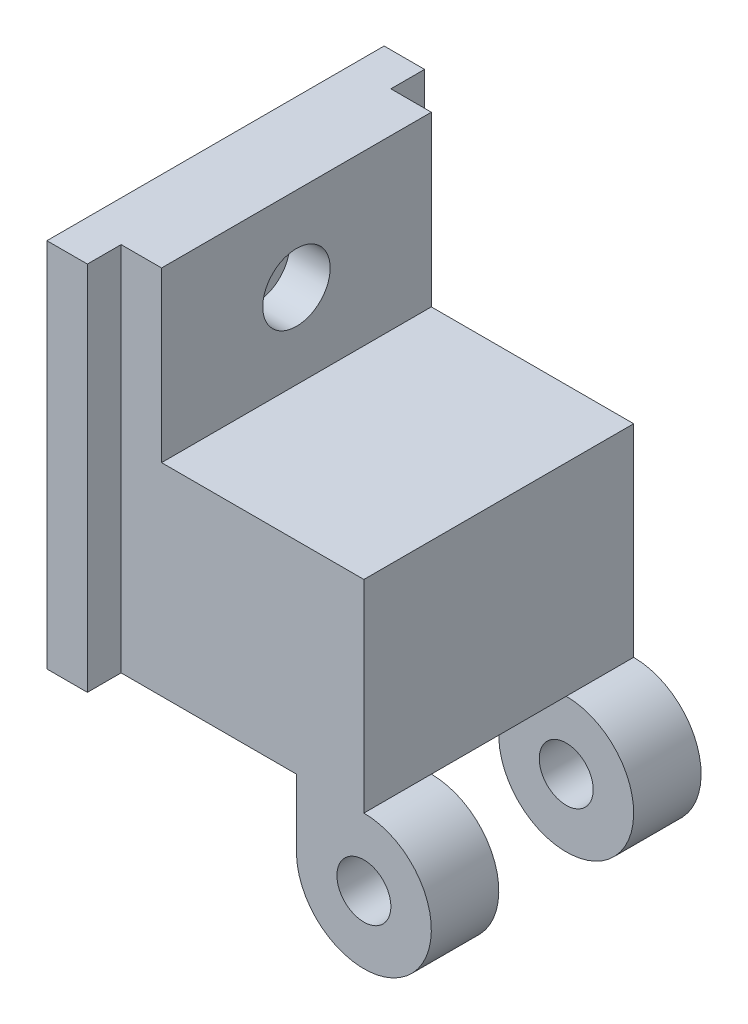
ISO-10303-21;
HEADER;
FILE_DESCRIPTION(('STEP AP214'),'2;1');
FILE_NAME('part.step','',(''),(''),'','','');
FILE_SCHEMA(('AUTOMOTIVE_DESIGN { 1 0 10303 214 1 1 1 1 }'));
ENDSEC;
DATA;
#1=APPLICATION_CONTEXT('core data for automotive mechanical design processes');
#2=APPLICATION_PROTOCOL_DEFINITION('international standard','automotive_design',2000,#1);
#3=PRODUCT_CONTEXT('',#1,'mechanical');
#4=PRODUCT('Part','Part','',(#3));
#5=PRODUCT_RELATED_PRODUCT_CATEGORY('part','',(#4));
#6=PRODUCT_DEFINITION_FORMATION('','',#4);
#7=PRODUCT_DEFINITION_CONTEXT('part definition',#1,'design');
#8=PRODUCT_DEFINITION('design','',#6,#7);
#9=PRODUCT_DEFINITION_SHAPE('','',#8);
#10=(LENGTH_UNIT() NAMED_UNIT(*) SI_UNIT(.MILLI.,.METRE.));
#11=(NAMED_UNIT(*) PLANE_ANGLE_UNIT() SI_UNIT($,.RADIAN.));
#12=(NAMED_UNIT(*) SI_UNIT($,.STERADIAN.) SOLID_ANGLE_UNIT());
#13=UNCERTAINTY_MEASURE_WITH_UNIT(LENGTH_MEASURE(1.E-05),#10,'distance_accuracy_value','');
#14=(GEOMETRIC_REPRESENTATION_CONTEXT(3) GLOBAL_UNCERTAINTY_ASSIGNED_CONTEXT((#13)) GLOBAL_UNIT_ASSIGNED_CONTEXT((#10,
#11,#12)) REPRESENTATION_CONTEXT('',''));
#15=CARTESIAN_POINT('',(0.,0.,0.));
#16=DIRECTION('',(0.,0.,1.));
#17=DIRECTION('',(1.,0.,0.));
#18=AXIS2_PLACEMENT_3D('',#15,#16,#17);
#19=CARTESIAN_POINT('',(15.,-12.5,-5.00000000000007));
#20=DIRECTION('',(0.,0.,-1.));
#21=DIRECTION('',(-1.,0.,0.));
#22=AXIS2_PLACEMENT_3D('',#19,#20,#21);
#23=CYLINDRICAL_SURFACE('',#22,5.);
#24=CARTESIAN_POINT('',(15.,-12.5,-10.0000000000001));
#25=DIRECTION('',(0.,0.,-1.));
#26=DIRECTION('',(-1.,0.,0.));
#27=AXIS2_PLACEMENT_3D('',#24,#25,#26);
#28=CIRCLE('',#27,5.);
#29=CARTESIAN_POINT('',(10.0155671222792,-12.1057552949038,-10.));
#30=VERTEX_POINT('',#29);
#31=CARTESIAN_POINT('',(15.,-7.50000000000001,-10.));
#32=VERTEX_POINT('',#31);
#33=EDGE_CURVE('E121',#30,#32,#28,.F.);
#34=ORIENTED_EDGE('',*,*,#33,.T.);
#35=DIRECTION('',(0.,0.,1.));
#36=VECTOR('',#35,1.);
#37=CARTESIAN_POINT('',(15.,-7.50000000000001,0.));
#38=LINE('',#37,#36);
#39=CARTESIAN_POINT('',(15.,-7.50000000000001,-5.00000000000006));
#40=VERTEX_POINT('',#39);
#41=EDGE_CURVE('E131',#32,#40,#38,.T.);
#42=ORIENTED_EDGE('',*,*,#41,.T.);
#43=CARTESIAN_POINT('',(15.,-12.5,-5.00000000000007));
#44=DIRECTION('',(0.,0.,-1.));
#45=DIRECTION('',(-1.,0.,0.));
#46=AXIS2_PLACEMENT_3D('',#43,#44,#45);
#47=CIRCLE('',#46,5.);
#48=CARTESIAN_POINT('',(10.0155671222792,-12.1057552949038,-5.00000000000007));
#49=VERTEX_POINT('',#48);
#50=EDGE_CURVE('E126',#40,#49,#47,.T.);
#51=ORIENTED_EDGE('',*,*,#50,.T.);
#52=DIRECTION('',(0.,0.,-1.));
#53=VECTOR('',#52,1.);
#54=CARTESIAN_POINT('',(10.0155671222792,-12.1057552949038,-5.00000000000007));
#55=LINE('',#54,#53);
#56=EDGE_CURVE('E128',#49,#30,#55,.T.);
#57=ORIENTED_EDGE('',*,*,#56,.T.);
#58=EDGE_LOOP('',(#34,#42,#51,#57));
#59=FACE_BOUND('',#58,.T.);
#60=ADVANCED_FACE('F17',(#59),#23,.T.);
#61=CARTESIAN_POINT('',(15.,-12.5,-5.00000000000007));
#62=DIRECTION('',(0.,0.,-1.));
#63=DIRECTION('',(-1.,0.,0.));
#64=AXIS2_PLACEMENT_3D('',#61,#62,#63);
#65=CYLINDRICAL_SURFACE('',#64,2.00000000000001);
#66=CARTESIAN_POINT('',(15.,-12.5,-10.0000000000001));
#67=DIRECTION('',(0.,0.,-1.));
#68=DIRECTION('',(-1.,0.,0.));
#69=AXIS2_PLACEMENT_3D('',#66,#67,#68);
#70=CIRCLE('',#69,2.00000000000001);
#71=CARTESIAN_POINT('',(13.,-12.5,-10.0000000000001));
#72=VERTEX_POINT('',#71);
#73=EDGE_CURVE('E240',#72,#72,#70,.T.);
#74=ORIENTED_EDGE('',*,*,#73,.T.);
#75=EDGE_LOOP('',(#74));
#76=FACE_BOUND('',#75,.T.);
#77=CARTESIAN_POINT('',(15.,-12.5,-5.00000000000007));
#78=DIRECTION('',(0.,0.,-1.));
#79=DIRECTION('',(-1.,0.,0.));
#80=AXIS2_PLACEMENT_3D('',#77,#78,#79);
#81=CIRCLE('',#80,2.00000000000001);
#82=CARTESIAN_POINT('',(13.,-12.5,-5.00000000000007));
#83=VERTEX_POINT('',#82);
#84=EDGE_CURVE('E136',#83,#83,#81,.F.);
#85=ORIENTED_EDGE('',*,*,#84,.T.);
#86=EDGE_LOOP('',(#85));
#87=FACE_BOUND('',#86,.T.);
#88=ADVANCED_FACE('F343',(#76,#87),#65,.F.);
#89=CARTESIAN_POINT('',(15.,-12.5,5.00000000000007));
#90=DIRECTION('',(0.,0.,1.));
#91=DIRECTION('',(1.,0.,0.));
#92=AXIS2_PLACEMENT_3D('',#89,#90,#91);
#93=CYLINDRICAL_SURFACE('',#92,5.);
#94=DIRECTION('',(0.,0.,1.));
#95=VECTOR('',#94,1.);
#96=CARTESIAN_POINT('',(10.0155671222792,-12.1057552949038,5.00000000000007));
#97=LINE('',#96,#95);
#98=CARTESIAN_POINT('',(10.0155671222792,-12.1057552949038,5.00000000000007));
#99=VERTEX_POINT('',#98);
#100=CARTESIAN_POINT('',(10.0155671222792,-12.1057552949038,10.0000000000001));
#101=VERTEX_POINT('',#100);
#102=EDGE_CURVE('E142',#99,#101,#97,.T.);
#103=ORIENTED_EDGE('',*,*,#102,.F.);
#104=CARTESIAN_POINT('',(15.,-12.5,5.00000000000007));
#105=DIRECTION('',(0.,0.,1.));
#106=DIRECTION('',(1.,0.,0.));
#107=AXIS2_PLACEMENT_3D('',#104,#105,#106);
#108=CIRCLE('',#107,5.);
#109=CARTESIAN_POINT('',(15.,-7.50000000000001,5.00000000000007));
#110=VERTEX_POINT('',#109);
#111=EDGE_CURVE('E182',#99,#110,#108,.T.);
#112=ORIENTED_EDGE('',*,*,#111,.T.);
#113=DIRECTION('',(0.,0.,1.));
#114=VECTOR('',#113,1.);
#115=CARTESIAN_POINT('',(15.,-7.50000000000001,0.));
#116=LINE('',#115,#114);
#117=CARTESIAN_POINT('',(15.,-7.50000000000001,10.0000000000001));
#118=VERTEX_POINT('',#117);
#119=EDGE_CURVE('E150',#110,#118,#116,.T.);
#120=ORIENTED_EDGE('',*,*,#119,.T.);
#121=CARTESIAN_POINT('',(15.,-12.5,10.0000000000001));
#122=DIRECTION('',(0.,0.,1.));
#123=DIRECTION('',(1.,0.,0.));
#124=AXIS2_PLACEMENT_3D('',#121,#122,#123);
#125=CIRCLE('',#124,5.);
#126=EDGE_CURVE('E258',#118,#101,#125,.F.);
#127=ORIENTED_EDGE('',*,*,#126,.T.);
#128=EDGE_LOOP('',(#103,#112,#120,#127));
#129=FACE_BOUND('',#128,.T.);
#130=ADVANCED_FACE('F345',(#129),#93,.T.);
#131=CARTESIAN_POINT('',(15.,-12.5,5.00000000000007));
#132=DIRECTION('',(0.,0.,1.));
#133=DIRECTION('',(1.,0.,0.));
#134=AXIS2_PLACEMENT_3D('',#131,#132,#133);
#135=CYLINDRICAL_SURFACE('',#134,2.00000000000001);
#136=CARTESIAN_POINT('',(15.,-12.5,5.00000000000007));
#137=DIRECTION('',(0.,0.,1.));
#138=DIRECTION('',(1.,0.,0.));
#139=AXIS2_PLACEMENT_3D('',#136,#137,#138);
#140=CIRCLE('',#139,2.00000000000001);
#141=CARTESIAN_POINT('',(17.,-12.5,5.00000000000007));
#142=VERTEX_POINT('',#141);
#143=EDGE_CURVE('E229',#142,#142,#140,.F.);
#144=ORIENTED_EDGE('',*,*,#143,.T.);
#145=EDGE_LOOP('',(#144));
#146=FACE_BOUND('',#145,.T.);
#147=CARTESIAN_POINT('',(15.,-12.5,10.0000000000001));
#148=DIRECTION('',(0.,0.,1.));
#149=DIRECTION('',(1.,0.,0.));
#150=AXIS2_PLACEMENT_3D('',#147,#148,#149);
#151=CIRCLE('',#150,2.00000000000001);
#152=CARTESIAN_POINT('',(17.,-12.5,10.0000000000001));
#153=VERTEX_POINT('',#152);
#154=EDGE_CURVE('E235',#153,#153,#151,.T.);
#155=ORIENTED_EDGE('',*,*,#154,.T.);
#156=EDGE_LOOP('',(#155));
#157=FACE_BOUND('',#156,.T.);
#158=ADVANCED_FACE('F270',(#146,#157),#135,.F.);
#159=CARTESIAN_POINT('',(-3.,13.75,0.));
#160=DIRECTION('',(1.,0.,0.));
#161=DIRECTION('',(0.,0.,-1.));
#162=AXIS2_PLACEMENT_3D('',#159,#160,#161);
#163=CYLINDRICAL_SURFACE('',#162,2.5);
#164=CARTESIAN_POINT('',(0.,13.75,0.));
#165=DIRECTION('',(1.,0.,0.));
#166=DIRECTION('',(0.,0.,-1.));
#167=AXIS2_PLACEMENT_3D('',#164,#165,#166);
#168=CIRCLE('',#167,2.5);
#169=CARTESIAN_POINT('',(0.,13.75,-2.5));
#170=VERTEX_POINT('',#169);
#171=EDGE_CURVE('E252',#170,#170,#168,.F.);
#172=ORIENTED_EDGE('',*,*,#171,.F.);
#173=EDGE_LOOP('',(#172));
#174=FACE_BOUND('',#173,.T.);
#175=CARTESIAN_POINT('',(-3.,13.75,0.));
#176=DIRECTION('',(1.,0.,0.));
#177=DIRECTION('',(0.,0.,-1.));
#178=AXIS2_PLACEMENT_3D('',#175,#176,#177);
#179=CIRCLE('',#178,2.5);
#180=CARTESIAN_POINT('',(-3.,13.75,-2.5));
#181=VERTEX_POINT('',#180);
#182=EDGE_CURVE('E20',#181,#181,#179,.T.);
#183=ORIENTED_EDGE('',*,*,#182,.F.);
#184=EDGE_LOOP('',(#183));
#185=FACE_BOUND('',#184,.T.);
#186=ADVANCED_FACE('F356',(#174,#185),#163,.F.);
#187=CARTESIAN_POINT('',(15.,7.50000000000001,10.0000000000001));
#188=DIRECTION('',(0.,-1.,0.));
#189=DIRECTION('',(0.,0.,-1.));
#190=AXIS2_PLACEMENT_3D('',#187,#188,#189);
#191=PLANE('',#190);
#192=DIRECTION('',(-1.,0.,0.));
#193=VECTOR('',#192,1.);
#194=CARTESIAN_POINT('',(15.,7.50000000000001,10.0000000000001));
#195=LINE('',#194,#193);
#196=CARTESIAN_POINT('',(0.,7.50000000000001,10.0000000000001));
#197=VERTEX_POINT('',#196);
#198=CARTESIAN_POINT('',(15.,7.50000000000001,10.0000000000001));
#199=VERTEX_POINT('',#198);
#200=EDGE_CURVE('E196',#197,#199,#195,.F.);
#201=ORIENTED_EDGE('',*,*,#200,.T.);
#202=DIRECTION('',(0.,0.,1.));
#203=VECTOR('',#202,1.);
#204=CARTESIAN_POINT('',(15.,7.50000000000001,0.));
#205=LINE('',#204,#203);
#206=CARTESIAN_POINT('',(15.,7.50000000000001,-9.99999999999993));
#207=VERTEX_POINT('',#206);
#208=EDGE_CURVE('E148',#199,#207,#205,.F.);
#209=ORIENTED_EDGE('',*,*,#208,.T.);
#210=DIRECTION('',(1.,0.,0.));
#211=VECTOR('',#210,1.);
#212=CARTESIAN_POINT('',(15.,7.50000000000001,-9.99999999999993));
#213=LINE('',#212,#211);
#214=CARTESIAN_POINT('',(0.,7.50000000000001,-9.99999999999993));
#215=VERTEX_POINT('',#214);
#216=EDGE_CURVE('E238',#207,#215,#213,.F.);
#217=ORIENTED_EDGE('',*,*,#216,.T.);
#218=DIRECTION('',(0.,0.,-1.));
#219=VECTOR('',#218,1.);
#220=CARTESIAN_POINT('',(0.,7.50000000000001,10.0000000000001));
#221=LINE('',#220,#219);
#222=EDGE_CURVE('E255',#197,#215,#221,.T.);
#223=ORIENTED_EDGE('',*,*,#222,.F.);
#224=EDGE_LOOP('',(#201,#209,#217,#223));
#225=FACE_BOUND('',#224,.T.);
#226=ADVANCED_FACE('F359',(#225),#191,.F.);
#227=CARTESIAN_POINT('',(-3.,13.75,0.));
#228=DIRECTION('',(1.,0.,0.));
#229=DIRECTION('',(0.,0.,-1.));
#230=AXIS2_PLACEMENT_3D('',#227,#228,#229);
#231=PLANE('',#230);
#232=ORIENTED_EDGE('',*,*,#182,.T.);
#233=EDGE_LOOP('',(#232));
#234=FACE_BOUND('',#233,.T.);
#235=CARTESIAN_POINT('',(-3.,13.75,0.));
#236=DIRECTION('',(1.,0.,0.));
#237=DIRECTION('',(0.,0.,-1.));
#238=AXIS2_PLACEMENT_3D('',#235,#236,#237);
#239=CIRCLE('',#238,1.5);
#240=CARTESIAN_POINT('',(-3.,13.75,-1.5));
#241=VERTEX_POINT('',#240);
#242=EDGE_CURVE('E248',#241,#241,#239,.F.);
#243=ORIENTED_EDGE('',*,*,#242,.T.);
#244=EDGE_LOOP('',(#243));
#245=FACE_BOUND('',#244,.T.);
#246=ADVANCED_FACE('F363',(#234,#245),#231,.T.);
#247=CARTESIAN_POINT('',(10.0155671222792,-12.1057552949038,-5.00000000000007));
#248=DIRECTION('',(1.,0.,0.));
#249=DIRECTION('',(0.,0.,-1.));
#250=AXIS2_PLACEMENT_3D('',#247,#248,#249);
#251=PLANE('',#250);
#252=ORIENTED_EDGE('',*,*,#56,.F.);
#253=DIRECTION('',(0.,1.,0.));
#254=VECTOR('',#253,1.);
#255=CARTESIAN_POINT('',(10.0155671222792,-12.5,-5.00000000000007));
#256=LINE('',#255,#254);
#257=CARTESIAN_POINT('',(10.0155671222792,-7.50000000000001,-5.00000000000006));
#258=VERTEX_POINT('',#257);
#259=EDGE_CURVE('E137',#49,#258,#256,.T.);
#260=ORIENTED_EDGE('',*,*,#259,.T.);
#261=DIRECTION('',(0.,0.,1.));
#262=VECTOR('',#261,1.);
#263=CARTESIAN_POINT('',(10.0155671222792,-7.50000000000001,10.0000000000001));
#264=LINE('',#263,#262);
#265=CARTESIAN_POINT('',(10.0155671222792,-7.50000000000001,-10.));
#266=VERTEX_POINT('',#265);
#267=EDGE_CURVE('E165',#258,#266,#264,.F.);
#268=ORIENTED_EDGE('',*,*,#267,.T.);
#269=DIRECTION('',(0.,1.,0.));
#270=VECTOR('',#269,1.);
#271=CARTESIAN_POINT('',(10.0155671222792,-7.50000000000001,-9.99999999999993));
#272=LINE('',#271,#270);
#273=EDGE_CURVE('E141',#266,#30,#272,.F.);
#274=ORIENTED_EDGE('',*,*,#273,.T.);
#275=EDGE_LOOP('',(#252,#260,#268,#274));
#276=FACE_BOUND('',#275,.T.);
#277=ADVANCED_FACE('F140',(#276),#251,.F.);
#278=CARTESIAN_POINT('',(10.0155671222792,-12.1057552949038,5.00000000000007));
#279=DIRECTION('',(-1.,0.,0.));
#280=DIRECTION('',(0.,0.,1.));
#281=AXIS2_PLACEMENT_3D('',#278,#279,#280);
#282=PLANE('',#281);
#283=DIRECTION('',(0.,1.,0.));
#284=VECTOR('',#283,1.);
#285=CARTESIAN_POINT('',(10.0155671222792,-12.5,5.00000000000007));
#286=LINE('',#285,#284);
#287=CARTESIAN_POINT('',(10.0155671222792,-7.50000000000001,5.00000000000007));
#288=VERTEX_POINT('',#287);
#289=EDGE_CURVE('E172',#288,#99,#286,.F.);
#290=ORIENTED_EDGE('',*,*,#289,.T.);
#291=ORIENTED_EDGE('',*,*,#102,.T.);
#292=DIRECTION('',(0.,1.,0.));
#293=VECTOR('',#292,1.);
#294=CARTESIAN_POINT('',(10.0155671222792,-7.50000000000001,10.0000000000001));
#295=LINE('',#294,#293);
#296=CARTESIAN_POINT('',(10.0155671222792,-7.50000000000001,10.0000000000001));
#297=VERTEX_POINT('',#296);
#298=EDGE_CURVE('E197',#101,#297,#295,.T.);
#299=ORIENTED_EDGE('',*,*,#298,.T.);
#300=DIRECTION('',(0.,0.,1.));
#301=VECTOR('',#300,1.);
#302=CARTESIAN_POINT('',(10.0155671222792,-7.50000000000001,10.0000000000001));
#303=LINE('',#302,#301);
#304=EDGE_CURVE('E177',#297,#288,#303,.F.);
#305=ORIENTED_EDGE('',*,*,#304,.T.);
#306=EDGE_LOOP('',(#290,#291,#299,#305));
#307=FACE_BOUND('',#306,.T.);
#308=ADVANCED_FACE('F276',(#307),#282,.T.);
#309=CARTESIAN_POINT('',(15.,-12.5,5.00000000000007));
#310=DIRECTION('',(0.,0.,1.));
#311=DIRECTION('',(1.,0.,0.));
#312=AXIS2_PLACEMENT_3D('',#309,#310,#311);
#313=PLANE('',#312);
#314=ORIENTED_EDGE('',*,*,#289,.F.);
#315=DIRECTION('',(1.,0.,0.));
#316=VECTOR('',#315,1.);
#317=CARTESIAN_POINT('',(15.,-7.50000000000001,5.00000000000007));
#318=LINE('',#317,#316);
#319=EDGE_CURVE('E160',#288,#110,#318,.T.);
#320=ORIENTED_EDGE('',*,*,#319,.T.);
#321=ORIENTED_EDGE('',*,*,#111,.F.);
#322=EDGE_LOOP('',(#314,#320,#321));
#323=FACE_BOUND('',#322,.T.);
#324=ORIENTED_EDGE('',*,*,#143,.F.);
#325=EDGE_LOOP('',(#324));
#326=FACE_BOUND('',#325,.T.);
#327=ADVANCED_FACE('F273',(#323,#326),#313,.F.);
#328=CARTESIAN_POINT('',(15.,0.,0.));
#329=DIRECTION('',(-1.,0.,0.));
#330=DIRECTION('',(0.,0.,1.));
#331=AXIS2_PLACEMENT_3D('',#328,#329,#330);
#332=PLANE('',#331);
#333=ORIENTED_EDGE('',*,*,#208,.F.);
#334=DIRECTION('',(0.,1.,0.));
#335=VECTOR('',#334,1.);
#336=CARTESIAN_POINT('',(15.,-7.50000000000001,10.0000000000001));
#337=LINE('',#336,#335);
#338=EDGE_CURVE('E260',#199,#118,#337,.F.);
#339=ORIENTED_EDGE('',*,*,#338,.T.);
#340=ORIENTED_EDGE('',*,*,#119,.F.);
#341=DIRECTION('',(0.,0.,1.));
#342=VECTOR('',#341,1.);
#343=CARTESIAN_POINT('',(15.,-7.50000000000001,10.0000000000001));
#344=LINE('',#343,#342);
#345=EDGE_CURVE('E158',#110,#40,#344,.F.);
#346=ORIENTED_EDGE('',*,*,#345,.T.);
#347=ORIENTED_EDGE('',*,*,#41,.F.);
#348=DIRECTION('',(0.,1.,0.));
#349=VECTOR('',#348,1.);
#350=CARTESIAN_POINT('',(15.,-7.50000000000001,-9.99999999999993));
#351=LINE('',#350,#349);
#352=EDGE_CURVE('E241',#32,#207,#351,.T.);
#353=ORIENTED_EDGE('',*,*,#352,.T.);
#354=EDGE_LOOP('',(#333,#339,#340,#346,#347,#353));
#355=FACE_BOUND('',#354,.T.);
#356=ADVANCED_FACE('F275',(#355),#332,.F.);
#357=CARTESIAN_POINT('',(15.,-12.5,-5.00000000000007));
#358=DIRECTION('',(0.,0.,-1.));
#359=DIRECTION('',(-1.,0.,0.));
#360=AXIS2_PLACEMENT_3D('',#357,#358,#359);
#361=PLANE('',#360);
#362=ORIENTED_EDGE('',*,*,#84,.F.);
#363=EDGE_LOOP('',(#362));
#364=FACE_BOUND('',#363,.T.);
#365=ORIENTED_EDGE('',*,*,#50,.F.);
#366=DIRECTION('',(1.,0.,0.));
#367=VECTOR('',#366,1.);
#368=CARTESIAN_POINT('',(15.,-7.50000000000001,-5.00000000000006));
#369=LINE('',#368,#367);
#370=EDGE_CURVE('E146',#40,#258,#369,.F.);
#371=ORIENTED_EDGE('',*,*,#370,.T.);
#372=ORIENTED_EDGE('',*,*,#259,.F.);
#373=EDGE_LOOP('',(#365,#371,#372));
#374=FACE_BOUND('',#373,.T.);
#375=ADVANCED_FACE('F144',(#364,#374),#361,.F.);
#376=CARTESIAN_POINT('',(15.,-7.50000000000001,-9.99999999999993));
#377=DIRECTION('',(0.,0.,1.));
#378=DIRECTION('',(1.,0.,0.));
#379=AXIS2_PLACEMENT_3D('',#376,#377,#378);
#380=PLANE('',#379);
#381=ORIENTED_EDGE('',*,*,#73,.F.);
#382=EDGE_LOOP('',(#381));
#383=FACE_BOUND('',#382,.T.);
#384=DIRECTION('',(0.,1.,0.));
#385=VECTOR('',#384,1.);
#386=CARTESIAN_POINT('',(-3.,20.,-9.99999999999993));
#387=LINE('',#386,#385);
#388=CARTESIAN_POINT('',(-3.,20.,-9.99999999999993));
#389=VERTEX_POINT('',#388);
#390=CARTESIAN_POINT('',(-3.,-7.50000000000001,-9.99999999999997));
#391=VERTEX_POINT('',#390);
#392=EDGE_CURVE('E263',#389,#391,#387,.F.);
#393=ORIENTED_EDGE('',*,*,#392,.F.);
#394=DIRECTION('',(1.,0.,0.));
#395=VECTOR('',#394,1.);
#396=CARTESIAN_POINT('',(0.,20.,-9.99999999999993));
#397=LINE('',#396,#395);
#398=CARTESIAN_POINT('',(0.,20.,-9.99999999999993));
#399=VERTEX_POINT('',#398);
#400=EDGE_CURVE('E206',#399,#389,#397,.F.);
#401=ORIENTED_EDGE('',*,*,#400,.F.);
#402=DIRECTION('',(0.,1.,0.));
#403=VECTOR('',#402,1.);
#404=CARTESIAN_POINT('',(0.,20.,-9.99999999999993));
#405=LINE('',#404,#403);
#406=EDGE_CURVE('E536',#215,#399,#405,.T.);
#407=ORIENTED_EDGE('',*,*,#406,.F.);
#408=ORIENTED_EDGE('',*,*,#216,.F.);
#409=ORIENTED_EDGE('',*,*,#352,.F.);
#410=ORIENTED_EDGE('',*,*,#33,.F.);
#411=ORIENTED_EDGE('',*,*,#273,.F.);
#412=DIRECTION('',(1.,0.,0.));
#413=VECTOR('',#412,1.);
#414=CARTESIAN_POINT('',(15.,-7.50000000000001,-10.0000000000001));
#415=LINE('',#414,#413);
#416=EDGE_CURVE('E167',#266,#391,#415,.F.);
#417=ORIENTED_EDGE('',*,*,#416,.T.);
#418=EDGE_LOOP('',(#393,#401,#407,#408,#409,#410,#411,#417));
#419=FACE_BOUND('',#418,.T.);
#420=ADVANCED_FACE('F332',(#383,#419),#380,.F.);
#421=CARTESIAN_POINT('',(-3.,20.,-12.5));
#422=DIRECTION('',(1.,0.,0.));
#423=DIRECTION('',(0.,0.,-1.));
#424=AXIS2_PLACEMENT_3D('',#421,#422,#423);
#425=PLANE('',#424);
#426=DIRECTION('',(0.,1.,0.));
#427=VECTOR('',#426,1.);
#428=CARTESIAN_POINT('',(-3.,20.,-12.5));
#429=LINE('',#428,#427);
#430=CARTESIAN_POINT('',(-3.,20.,-12.5));
#431=VERTEX_POINT('',#430);
#432=CARTESIAN_POINT('',(-3.,-7.50000000000001,-12.5));
#433=VERTEX_POINT('',#432);
#434=EDGE_CURVE('E168',#431,#433,#429,.F.);
#435=ORIENTED_EDGE('',*,*,#434,.F.);
#436=DIRECTION('',(0.,0.,1.));
#437=VECTOR('',#436,1.);
#438=CARTESIAN_POINT('',(-3.,20.,0.));
#439=LINE('',#438,#437);
#440=EDGE_CURVE('E556',#389,#431,#439,.F.);
#441=ORIENTED_EDGE('',*,*,#440,.F.);
#442=ORIENTED_EDGE('',*,*,#392,.T.);
#443=DIRECTION('',(0.,0.,1.));
#444=VECTOR('',#443,1.);
#445=CARTESIAN_POINT('',(-3.,-7.50000000000001,10.0000000000001));
#446=LINE('',#445,#444);
#447=EDGE_CURVE('E214',#391,#433,#446,.F.);
#448=ORIENTED_EDGE('',*,*,#447,.T.);
#449=EDGE_LOOP('',(#435,#441,#442,#448));
#450=FACE_BOUND('',#449,.T.);
#451=ADVANCED_FACE('F328',(#450),#425,.T.);
#452=CARTESIAN_POINT('',(-3.,20.,10.0000000000001));
#453=DIRECTION('',(1.,0.,0.));
#454=DIRECTION('',(0.,0.,-1.));
#455=AXIS2_PLACEMENT_3D('',#452,#453,#454);
#456=PLANE('',#455);
#457=DIRECTION('',(0.,1.,0.));
#458=VECTOR('',#457,1.);
#459=CARTESIAN_POINT('',(-3.,-7.50000000000001,10.0000000000001));
#460=LINE('',#459,#458);
#461=CARTESIAN_POINT('',(-3.,-7.50000000000001,10.0000000000001));
#462=VERTEX_POINT('',#461);
#463=CARTESIAN_POINT('',(-3.,20.,10.0000000000001));
#464=VERTEX_POINT('',#463);
#465=EDGE_CURVE('E194',#462,#464,#460,.T.);
#466=ORIENTED_EDGE('',*,*,#465,.T.);
#467=DIRECTION('',(0.,0.,1.));
#468=VECTOR('',#467,1.);
#469=CARTESIAN_POINT('',(-3.,20.,0.));
#470=LINE('',#469,#468);
#471=CARTESIAN_POINT('',(-3.,20.,12.5));
#472=VERTEX_POINT('',#471);
#473=EDGE_CURVE('E221',#472,#464,#470,.F.);
#474=ORIENTED_EDGE('',*,*,#473,.F.);
#475=DIRECTION('',(0.,1.,0.));
#476=VECTOR('',#475,1.);
#477=CARTESIAN_POINT('',(-3.,20.,12.5));
#478=LINE('',#477,#476);
#479=CARTESIAN_POINT('',(-3.,-7.50000000000001,12.5));
#480=VERTEX_POINT('',#479);
#481=EDGE_CURVE('E204',#480,#472,#478,.T.);
#482=ORIENTED_EDGE('',*,*,#481,.F.);
#483=DIRECTION('',(0.,0.,1.));
#484=VECTOR('',#483,1.);
#485=CARTESIAN_POINT('',(-3.,-7.50000000000001,10.0000000000001));
#486=LINE('',#485,#484);
#487=EDGE_CURVE('E191',#480,#462,#486,.F.);
#488=ORIENTED_EDGE('',*,*,#487,.T.);
#489=EDGE_LOOP('',(#466,#474,#482,#488));
#490=FACE_BOUND('',#489,.T.);
#491=ADVANCED_FACE('F324',(#490),#456,.T.);
#492=CARTESIAN_POINT('',(15.,-7.50000000000001,10.0000000000001));
#493=DIRECTION('',(0.,0.,-1.));
#494=DIRECTION('',(-1.,0.,0.));
#495=AXIS2_PLACEMENT_3D('',#492,#493,#494);
#496=PLANE('',#495);
#497=ORIENTED_EDGE('',*,*,#154,.F.);
#498=EDGE_LOOP('',(#497));
#499=FACE_BOUND('',#498,.T.);
#500=DIRECTION('',(0.,1.,0.));
#501=VECTOR('',#500,1.);
#502=CARTESIAN_POINT('',(0.,20.,10.0000000000001));
#503=LINE('',#502,#501);
#504=CARTESIAN_POINT('',(0.,20.,10.0000000000001));
#505=VERTEX_POINT('',#504);
#506=EDGE_CURVE('E251',#505,#197,#503,.F.);
#507=ORIENTED_EDGE('',*,*,#506,.F.);
#508=DIRECTION('',(1.,0.,0.));
#509=VECTOR('',#508,1.);
#510=CARTESIAN_POINT('',(0.,20.,10.0000000000001));
#511=LINE('',#510,#509);
#512=EDGE_CURVE('E217',#464,#505,#511,.T.);
#513=ORIENTED_EDGE('',*,*,#512,.F.);
#514=ORIENTED_EDGE('',*,*,#465,.F.);
#515=DIRECTION('',(1.,0.,0.));
#516=VECTOR('',#515,1.);
#517=CARTESIAN_POINT('',(15.,-7.50000000000001,10.0000000000001));
#518=LINE('',#517,#516);
#519=EDGE_CURVE('E186',#462,#297,#518,.T.);
#520=ORIENTED_EDGE('',*,*,#519,.T.);
#521=ORIENTED_EDGE('',*,*,#298,.F.);
#522=ORIENTED_EDGE('',*,*,#126,.F.);
#523=ORIENTED_EDGE('',*,*,#338,.F.);
#524=ORIENTED_EDGE('',*,*,#200,.F.);
#525=EDGE_LOOP('',(#507,#513,#514,#520,#521,#522,#523,#524));
#526=FACE_BOUND('',#525,.T.);
#527=ADVANCED_FACE('F320',(#499,#526),#496,.F.);
#528=CARTESIAN_POINT('',(0.,20.,10.0000000000001));
#529=DIRECTION('',(1.,0.,0.));
#530=DIRECTION('',(0.,0.,-1.));
#531=AXIS2_PLACEMENT_3D('',#528,#529,#530);
#532=PLANE('',#531);
#533=DIRECTION('',(0.,0.,1.));
#534=VECTOR('',#533,1.);
#535=CARTESIAN_POINT('',(0.,20.,0.));
#536=LINE('',#535,#534);
#537=EDGE_CURVE('E220',#505,#399,#536,.F.);
#538=ORIENTED_EDGE('',*,*,#537,.F.);
#539=ORIENTED_EDGE('',*,*,#506,.T.);
#540=ORIENTED_EDGE('',*,*,#222,.T.);
#541=ORIENTED_EDGE('',*,*,#406,.T.);
#542=EDGE_LOOP('',(#538,#539,#540,#541));
#543=FACE_BOUND('',#542,.T.);
#544=ORIENTED_EDGE('',*,*,#171,.T.);
#545=EDGE_LOOP('',(#544));
#546=FACE_BOUND('',#545,.T.);
#547=ADVANCED_FACE('F316',(#543,#546),#532,.T.);
#548=CARTESIAN_POINT('',(-10.2426406871193,13.75,0.));
#549=DIRECTION('',(1.,0.,0.));
#550=DIRECTION('',(0.,0.,-1.));
#551=AXIS2_PLACEMENT_3D('',#548,#549,#550);
#552=CYLINDRICAL_SURFACE('',#551,1.5);
#553=ORIENTED_EDGE('',*,*,#242,.F.);
#554=EDGE_LOOP('',(#553));
#555=FACE_BOUND('',#554,.T.);
#556=CARTESIAN_POINT('',(-6.,13.75,0.));
#557=DIRECTION('',(1.,0.,0.));
#558=DIRECTION('',(0.,0.,-1.));
#559=AXIS2_PLACEMENT_3D('',#556,#557,#558);
#560=CIRCLE('',#559,1.5);
#561=CARTESIAN_POINT('',(-6.,13.75,-1.5));
#562=VERTEX_POINT('',#561);
#563=EDGE_CURVE('E244',#562,#562,#560,.T.);
#564=ORIENTED_EDGE('',*,*,#563,.F.);
#565=EDGE_LOOP('',(#564));
#566=FACE_BOUND('',#565,.T.);
#567=ADVANCED_FACE('F312',(#555,#566),#552,.F.);
#568=CARTESIAN_POINT('',(-6.,20.,-12.5));
#569=DIRECTION('',(0.,0.,-1.));
#570=DIRECTION('',(-1.,0.,0.));
#571=AXIS2_PLACEMENT_3D('',#568,#569,#570);
#572=PLANE('',#571);
#573=DIRECTION('',(0.,1.,0.));
#574=VECTOR('',#573,1.);
#575=CARTESIAN_POINT('',(-6.,20.,-12.5));
#576=LINE('',#575,#574);
#577=CARTESIAN_POINT('',(-6.,20.,-12.5));
#578=VERTEX_POINT('',#577);
#579=CARTESIAN_POINT('',(-6.,-7.50000000000001,-12.5));
#580=VERTEX_POINT('',#579);
#581=EDGE_CURVE('E247',#578,#580,#576,.F.);
#582=ORIENTED_EDGE('',*,*,#581,.F.);
#583=DIRECTION('',(1.,0.,0.));
#584=VECTOR('',#583,1.);
#585=CARTESIAN_POINT('',(0.,20.,-12.5));
#586=LINE('',#585,#584);
#587=EDGE_CURVE('E565',#431,#578,#586,.F.);
#588=ORIENTED_EDGE('',*,*,#587,.F.);
#589=ORIENTED_EDGE('',*,*,#434,.T.);
#590=DIRECTION('',(1.,0.,0.));
#591=VECTOR('',#590,1.);
#592=CARTESIAN_POINT('',(15.,-7.50000000000001,-12.5));
#593=LINE('',#592,#591);
#594=EDGE_CURVE('E201',#433,#580,#593,.F.);
#595=ORIENTED_EDGE('',*,*,#594,.T.);
#596=EDGE_LOOP('',(#582,#588,#589,#595));
#597=FACE_BOUND('',#596,.T.);
#598=ADVANCED_FACE('F308',(#597),#572,.T.);
#599=CARTESIAN_POINT('',(15.,-7.50000000000001,10.0000000000001));
#600=DIRECTION('',(0.,1.,0.));
#601=DIRECTION('',(0.,0.,1.));
#602=AXIS2_PLACEMENT_3D('',#599,#600,#601);
#603=PLANE('',#602);
#604=ORIENTED_EDGE('',*,*,#345,.F.);
#605=ORIENTED_EDGE('',*,*,#319,.F.);
#606=ORIENTED_EDGE('',*,*,#304,.F.);
#607=ORIENTED_EDGE('',*,*,#519,.F.);
#608=ORIENTED_EDGE('',*,*,#487,.F.);
#609=DIRECTION('',(1.,0.,0.));
#610=VECTOR('',#609,1.);
#611=CARTESIAN_POINT('',(-3.,-7.50000000000001,12.5));
#612=LINE('',#611,#610);
#613=CARTESIAN_POINT('',(-6.,-7.50000000000001,12.5));
#614=VERTEX_POINT('',#613);
#615=EDGE_CURVE('E162',#614,#480,#612,.T.);
#616=ORIENTED_EDGE('',*,*,#615,.F.);
#617=DIRECTION('',(0.,0.,1.));
#618=VECTOR('',#617,1.);
#619=CARTESIAN_POINT('',(-6.,-7.50000000000001,12.5));
#620=LINE('',#619,#618);
#621=EDGE_CURVE('E573',#580,#614,#620,.T.);
#622=ORIENTED_EDGE('',*,*,#621,.F.);
#623=ORIENTED_EDGE('',*,*,#594,.F.);
#624=ORIENTED_EDGE('',*,*,#447,.F.);
#625=ORIENTED_EDGE('',*,*,#416,.F.);
#626=ORIENTED_EDGE('',*,*,#267,.F.);
#627=ORIENTED_EDGE('',*,*,#370,.F.);
#628=EDGE_LOOP('',(#604,#605,#606,#607,#608,#616,#622,#623,#624,#625,#626,#627));
#629=FACE_BOUND('',#628,.T.);
#630=ADVANCED_FACE('F305',(#629),#603,.F.);
#631=CARTESIAN_POINT('',(-3.,20.,12.5));
#632=DIRECTION('',(0.,0.,1.));
#633=DIRECTION('',(1.,0.,0.));
#634=AXIS2_PLACEMENT_3D('',#631,#632,#633);
#635=PLANE('',#634);
#636=ORIENTED_EDGE('',*,*,#481,.T.);
#637=DIRECTION('',(1.,0.,0.));
#638=VECTOR('',#637,1.);
#639=CARTESIAN_POINT('',(0.,20.,12.5));
#640=LINE('',#639,#638);
#641=CARTESIAN_POINT('',(-6.,20.,12.5));
#642=VERTEX_POINT('',#641);
#643=EDGE_CURVE('E35',#642,#472,#640,.T.);
#644=ORIENTED_EDGE('',*,*,#643,.F.);
#645=DIRECTION('',(0.,1.,0.));
#646=VECTOR('',#645,1.);
#647=CARTESIAN_POINT('',(-6.,20.,12.5));
#648=LINE('',#647,#646);
#649=EDGE_CURVE('E26',#614,#642,#648,.T.);
#650=ORIENTED_EDGE('',*,*,#649,.F.);
#651=ORIENTED_EDGE('',*,*,#615,.T.);
#652=EDGE_LOOP('',(#636,#644,#650,#651));
#653=FACE_BOUND('',#652,.T.);
#654=ADVANCED_FACE('F297',(#653),#635,.T.);
#655=CARTESIAN_POINT('',(0.,20.,0.));
#656=DIRECTION('',(0.,1.,0.));
#657=DIRECTION('',(0.,0.,1.));
#658=AXIS2_PLACEMENT_3D('',#655,#656,#657);
#659=PLANE('',#658);
#660=ORIENTED_EDGE('',*,*,#512,.T.);
#661=ORIENTED_EDGE('',*,*,#537,.T.);
#662=ORIENTED_EDGE('',*,*,#400,.T.);
#663=ORIENTED_EDGE('',*,*,#440,.T.);
#664=ORIENTED_EDGE('',*,*,#587,.T.);
#665=DIRECTION('',(0.,0.,1.));
#666=VECTOR('',#665,1.);
#667=CARTESIAN_POINT('',(-6.,20.,12.5));
#668=LINE('',#667,#666);
#669=EDGE_CURVE('E11',#642,#578,#668,.F.);
#670=ORIENTED_EDGE('',*,*,#669,.F.);
#671=ORIENTED_EDGE('',*,*,#643,.T.);
#672=ORIENTED_EDGE('',*,*,#473,.T.);
#673=EDGE_LOOP('',(#660,#661,#662,#663,#664,#670,#671,#672));
#674=FACE_BOUND('',#673,.T.);
#675=ADVANCED_FACE('F291',(#674),#659,.T.);
#676=CARTESIAN_POINT('',(-6.,20.,12.5));
#677=DIRECTION('',(-1.,0.,0.));
#678=DIRECTION('',(0.,0.,1.));
#679=AXIS2_PLACEMENT_3D('',#676,#677,#678);
#680=PLANE('',#679);
#681=ORIENTED_EDGE('',*,*,#649,.T.);
#682=ORIENTED_EDGE('',*,*,#669,.T.);
#683=ORIENTED_EDGE('',*,*,#581,.T.);
#684=ORIENTED_EDGE('',*,*,#621,.T.);
#685=EDGE_LOOP('',(#681,#682,#683,#684));
#686=FACE_BOUND('',#685,.T.);
#687=ORIENTED_EDGE('',*,*,#563,.T.);
#688=EDGE_LOOP('',(#687));
#689=FACE_BOUND('',#688,.T.);
#690=ADVANCED_FACE('F289',(#686,#689),#680,.T.);
#691=CLOSED_SHELL('',(#60,#88,#130,#158,#186,#226,#246,#277,#308,#327,#356,#375,#420,#451,#491,
#527,#547,#567,#598,#630,#654,#675,#690));
#692=MANIFOLD_SOLID_BREP('B1',#691);
#693=ADVANCED_BREP_SHAPE_REPRESENTATION('',(#18,#692),#14);
#694=SHAPE_DEFINITION_REPRESENTATION(#9,#693);
ENDSEC;
END-ISO-10303-21;
